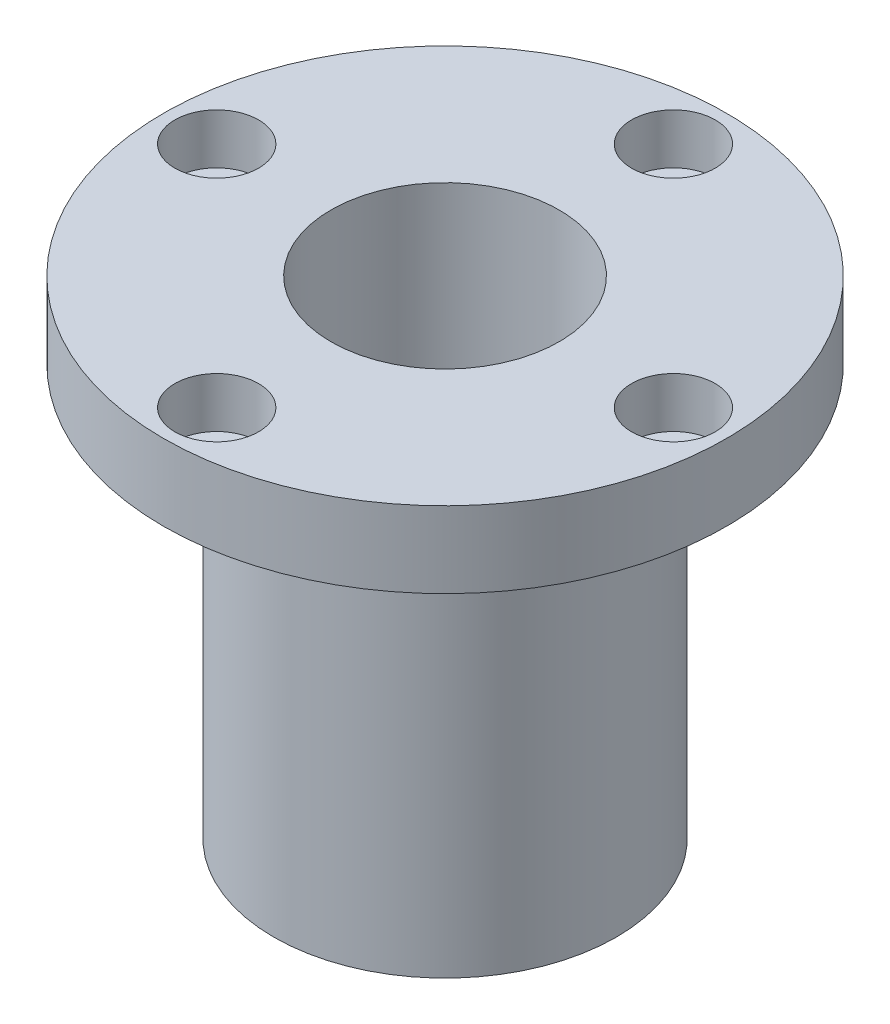
ISO-10303-21;
HEADER;
FILE_DESCRIPTION(('STEP AP214'),'2;1');
FILE_NAME('part.step','',(''),(''),'','','');
FILE_SCHEMA(('AUTOMOTIVE_DESIGN { 1 0 10303 214 1 1 1 1 }'));
ENDSEC;
DATA;
#1=APPLICATION_CONTEXT('core data for automotive mechanical design processes');
#2=APPLICATION_PROTOCOL_DEFINITION('international standard','automotive_design',2000,#1);
#3=PRODUCT_CONTEXT('',#1,'mechanical');
#4=PRODUCT('Part','Part','',(#3));
#5=PRODUCT_RELATED_PRODUCT_CATEGORY('part','',(#4));
#6=PRODUCT_DEFINITION_FORMATION('','',#4);
#7=PRODUCT_DEFINITION_CONTEXT('part definition',#1,'design');
#8=PRODUCT_DEFINITION('design','',#6,#7);
#9=PRODUCT_DEFINITION_SHAPE('','',#8);
#10=(LENGTH_UNIT() NAMED_UNIT(*) SI_UNIT(.MILLI.,.METRE.));
#11=(NAMED_UNIT(*) PLANE_ANGLE_UNIT() SI_UNIT($,.RADIAN.));
#12=(NAMED_UNIT(*) SI_UNIT($,.STERADIAN.) SOLID_ANGLE_UNIT());
#13=UNCERTAINTY_MEASURE_WITH_UNIT(LENGTH_MEASURE(1.E-05),#10,'distance_accuracy_value','');
#14=(GEOMETRIC_REPRESENTATION_CONTEXT(3) GLOBAL_UNCERTAINTY_ASSIGNED_CONTEXT((#13)) GLOBAL_UNIT_ASSIGNED_CONTEXT((#10,
#11,#12)) REPRESENTATION_CONTEXT('',''));
#15=CARTESIAN_POINT('',(0.,0.,0.));
#16=DIRECTION('',(0.,0.,1.));
#17=DIRECTION('',(1.,0.,0.));
#18=AXIS2_PLACEMENT_3D('',#15,#16,#17);
#19=CARTESIAN_POINT('',(0.,64.,0.));
#20=DIRECTION('',(0.,-1.,0.));
#21=DIRECTION('',(0.,0.,-1.));
#22=AXIS2_PLACEMENT_3D('',#19,#20,#21);
#23=CYLINDRICAL_SURFACE('',#22,22.5);
#24=CARTESIAN_POINT('',(0.,0.,0.));
#25=DIRECTION('',(0.,1.,0.));
#26=DIRECTION('',(0.,0.,1.));
#27=AXIS2_PLACEMENT_3D('',#24,#25,#26);
#28=CIRCLE('',#27,22.5);
#29=CARTESIAN_POINT('',(0.,0.,22.5));
#30=VERTEX_POINT('',#29);
#31=EDGE_CURVE('E46',#30,#30,#28,.T.);
#32=ORIENTED_EDGE('',*,*,#31,.T.);
#33=EDGE_LOOP('',(#32));
#34=FACE_BOUND('',#33,.T.);
#35=CARTESIAN_POINT('',(0.,54.,0.));
#36=DIRECTION('',(0.,1.,0.));
#37=DIRECTION('',(0.,0.,1.));
#38=AXIS2_PLACEMENT_3D('',#35,#36,#37);
#39=CIRCLE('',#38,22.5);
#40=CARTESIAN_POINT('',(0.,54.,22.5));
#41=VERTEX_POINT('',#40);
#42=EDGE_CURVE('E10',#41,#41,#39,.T.);
#43=ORIENTED_EDGE('',*,*,#42,.F.);
#44=EDGE_LOOP('',(#43));
#45=FACE_BOUND('',#44,.T.);
#46=ADVANCED_FACE('F39',(#34,#45),#23,.T.);
#47=CARTESIAN_POINT('',(0.,64.,0.));
#48=DIRECTION('',(0.,1.,0.));
#49=DIRECTION('',(0.,0.,1.));
#50=AXIS2_PLACEMENT_3D('',#47,#48,#49);
#51=PLANE('',#50);
#52=CARTESIAN_POINT('',(0.,64.,-30.));
#53=DIRECTION('',(0.,1.,0.));
#54=DIRECTION('',(0.,0.,1.));
#55=AXIS2_PLACEMENT_3D('',#52,#53,#54);
#56=CIRCLE('',#55,5.5);
#57=CARTESIAN_POINT('',(0.,64.,-24.5));
#58=VERTEX_POINT('',#57);
#59=EDGE_CURVE('E83',#58,#58,#56,.T.);
#60=ORIENTED_EDGE('',*,*,#59,.F.);
#61=EDGE_LOOP('',(#60));
#62=FACE_BOUND('',#61,.T.);
#63=CARTESIAN_POINT('',(30.,64.,0.));
#64=DIRECTION('',(0.,1.,0.));
#65=DIRECTION('',(0.,0.,1.));
#66=AXIS2_PLACEMENT_3D('',#63,#64,#65);
#67=CIRCLE('',#66,5.49999999999999);
#68=CARTESIAN_POINT('',(30.,64.,5.49999999999999));
#69=VERTEX_POINT('',#68);
#70=EDGE_CURVE('E86',#69,#69,#67,.T.);
#71=ORIENTED_EDGE('',*,*,#70,.F.);
#72=EDGE_LOOP('',(#71));
#73=FACE_BOUND('',#72,.T.);
#74=CARTESIAN_POINT('',(0.,64.,30.));
#75=DIRECTION('',(0.,1.,0.));
#76=DIRECTION('',(0.,0.,1.));
#77=AXIS2_PLACEMENT_3D('',#74,#75,#76);
#78=CIRCLE('',#77,5.5);
#79=CARTESIAN_POINT('',(0.,64.,35.5));
#80=VERTEX_POINT('',#79);
#81=EDGE_CURVE('E92',#80,#80,#78,.T.);
#82=ORIENTED_EDGE('',*,*,#81,.F.);
#83=EDGE_LOOP('',(#82));
#84=FACE_BOUND('',#83,.T.);
#85=CARTESIAN_POINT('',(-30.,64.,0.));
#86=DIRECTION('',(0.,1.,0.));
#87=DIRECTION('',(0.,0.,1.));
#88=AXIS2_PLACEMENT_3D('',#85,#86,#87);
#89=CIRCLE('',#88,5.5);
#90=CARTESIAN_POINT('',(-30.,64.,5.5));
#91=VERTEX_POINT('',#90);
#92=EDGE_CURVE('E98',#91,#91,#89,.T.);
#93=ORIENTED_EDGE('',*,*,#92,.F.);
#94=EDGE_LOOP('',(#93));
#95=FACE_BOUND('',#94,.T.);
#96=CARTESIAN_POINT('',(0.,64.,0.));
#97=DIRECTION('',(0.,1.,0.));
#98=DIRECTION('',(0.,0.,1.));
#99=AXIS2_PLACEMENT_3D('',#96,#97,#98);
#100=CIRCLE('',#99,15.);
#101=CARTESIAN_POINT('',(0.,64.,15.));
#102=VERTEX_POINT('',#101);
#103=EDGE_CURVE('E51',#102,#102,#100,.T.);
#104=ORIENTED_EDGE('',*,*,#103,.F.);
#105=EDGE_LOOP('',(#104));
#106=FACE_BOUND('',#105,.T.);
#107=CARTESIAN_POINT('',(0.,64.,0.));
#108=DIRECTION('',(0.,1.,0.));
#109=DIRECTION('',(0.,0.,1.));
#110=AXIS2_PLACEMENT_3D('',#107,#108,#109);
#111=CIRCLE('',#110,37.);
#112=CARTESIAN_POINT('',(0.,64.,37.));
#113=VERTEX_POINT('',#112);
#114=EDGE_CURVE('E82',#113,#113,#111,.T.);
#115=ORIENTED_EDGE('',*,*,#114,.T.);
#116=EDGE_LOOP('',(#115));
#117=FACE_BOUND('',#116,.T.);
#118=ADVANCED_FACE('F128',(#62,#73,#84,#95,#106,#117),#51,.T.);
#119=CARTESIAN_POINT('',(0.,0.,0.));
#120=DIRECTION('',(0.,1.,0.));
#121=DIRECTION('',(0.,0.,1.));
#122=AXIS2_PLACEMENT_3D('',#119,#120,#121);
#123=PLANE('',#122);
#124=ORIENTED_EDGE('',*,*,#31,.F.);
#125=EDGE_LOOP('',(#124));
#126=FACE_BOUND('',#125,.T.);
#127=CARTESIAN_POINT('',(0.,0.,0.));
#128=DIRECTION('',(0.,1.,0.));
#129=DIRECTION('',(0.,0.,1.));
#130=AXIS2_PLACEMENT_3D('',#127,#128,#129);
#131=CIRCLE('',#130,15.);
#132=CARTESIAN_POINT('',(0.,0.,15.));
#133=VERTEX_POINT('',#132);
#134=EDGE_CURVE('E106',#133,#133,#131,.T.);
#135=ORIENTED_EDGE('',*,*,#134,.T.);
#136=EDGE_LOOP('',(#135));
#137=FACE_BOUND('',#136,.T.);
#138=ADVANCED_FACE('F113',(#126,#137),#123,.F.);
#139=CARTESIAN_POINT('',(0.,64.,0.));
#140=DIRECTION('',(0.,-1.,0.));
#141=DIRECTION('',(0.,0.,-1.));
#142=AXIS2_PLACEMENT_3D('',#139,#140,#141);
#143=CYLINDRICAL_SURFACE('',#142,15.);
#144=ORIENTED_EDGE('',*,*,#103,.T.);
#145=EDGE_LOOP('',(#144));
#146=FACE_BOUND('',#145,.T.);
#147=ORIENTED_EDGE('',*,*,#134,.F.);
#148=EDGE_LOOP('',(#147));
#149=FACE_BOUND('',#148,.T.);
#150=ADVANCED_FACE('F115',(#146,#149),#143,.F.);
#151=CARTESIAN_POINT('',(0.,54.,0.));
#152=DIRECTION('',(0.,1.,0.));
#153=DIRECTION('',(0.,0.,1.));
#154=AXIS2_PLACEMENT_3D('',#151,#152,#153);
#155=CYLINDRICAL_SURFACE('',#154,37.);
#156=CARTESIAN_POINT('',(0.,54.,0.));
#157=DIRECTION('',(0.,1.,0.));
#158=DIRECTION('',(0.,0.,1.));
#159=AXIS2_PLACEMENT_3D('',#156,#157,#158);
#160=CIRCLE('',#159,37.);
#161=CARTESIAN_POINT('',(0.,54.,37.));
#162=VERTEX_POINT('',#161);
#163=EDGE_CURVE('E103',#162,#162,#160,.T.);
#164=ORIENTED_EDGE('',*,*,#163,.T.);
#165=EDGE_LOOP('',(#164));
#166=FACE_BOUND('',#165,.T.);
#167=ORIENTED_EDGE('',*,*,#114,.F.);
#168=EDGE_LOOP('',(#167));
#169=FACE_BOUND('',#168,.T.);
#170=ADVANCED_FACE('F117',(#166,#169),#155,.T.);
#171=CARTESIAN_POINT('',(0.,54.,0.));
#172=DIRECTION('',(0.,1.,0.));
#173=DIRECTION('',(0.,0.,1.));
#174=AXIS2_PLACEMENT_3D('',#171,#172,#173);
#175=PLANE('',#174);
#176=CARTESIAN_POINT('',(0.,54.,-30.));
#177=DIRECTION('',(0.,1.,0.));
#178=DIRECTION('',(0.,0.,1.));
#179=AXIS2_PLACEMENT_3D('',#176,#177,#178);
#180=CIRCLE('',#179,3.3);
#181=CARTESIAN_POINT('',(0.,54.,-26.7));
#182=VERTEX_POINT('',#181);
#183=EDGE_CURVE('E58',#182,#182,#180,.T.);
#184=ORIENTED_EDGE('',*,*,#183,.T.);
#185=EDGE_LOOP('',(#184));
#186=FACE_BOUND('',#185,.T.);
#187=CARTESIAN_POINT('',(30.,54.,0.));
#188=DIRECTION('',(0.,1.,0.));
#189=DIRECTION('',(0.,0.,1.));
#190=AXIS2_PLACEMENT_3D('',#187,#188,#189);
#191=CIRCLE('',#190,3.3);
#192=CARTESIAN_POINT('',(30.,54.,3.3));
#193=VERTEX_POINT('',#192);
#194=EDGE_CURVE('E61',#193,#193,#191,.T.);
#195=ORIENTED_EDGE('',*,*,#194,.T.);
#196=EDGE_LOOP('',(#195));
#197=FACE_BOUND('',#196,.T.);
#198=CARTESIAN_POINT('',(0.,54.,30.));
#199=DIRECTION('',(0.,1.,0.));
#200=DIRECTION('',(0.,0.,1.));
#201=AXIS2_PLACEMENT_3D('',#198,#199,#200);
#202=CIRCLE('',#201,3.3);
#203=CARTESIAN_POINT('',(0.,54.,33.3));
#204=VERTEX_POINT('',#203);
#205=EDGE_CURVE('E64',#204,#204,#202,.T.);
#206=ORIENTED_EDGE('',*,*,#205,.T.);
#207=EDGE_LOOP('',(#206));
#208=FACE_BOUND('',#207,.T.);
#209=CARTESIAN_POINT('',(-30.,54.,0.));
#210=DIRECTION('',(0.,1.,0.));
#211=DIRECTION('',(0.,0.,1.));
#212=AXIS2_PLACEMENT_3D('',#209,#210,#211);
#213=CIRCLE('',#212,3.3);
#214=CARTESIAN_POINT('',(-30.,54.,3.3));
#215=VERTEX_POINT('',#214);
#216=EDGE_CURVE('E75',#215,#215,#213,.T.);
#217=ORIENTED_EDGE('',*,*,#216,.T.);
#218=EDGE_LOOP('',(#217));
#219=FACE_BOUND('',#218,.T.);
#220=ORIENTED_EDGE('',*,*,#42,.T.);
#221=EDGE_LOOP('',(#220));
#222=FACE_BOUND('',#221,.T.);
#223=ORIENTED_EDGE('',*,*,#163,.F.);
#224=EDGE_LOOP('',(#223));
#225=FACE_BOUND('',#224,.T.);
#226=ADVANCED_FACE('F125',(#186,#197,#208,#219,#222,#225),#175,.F.);
#227=CARTESIAN_POINT('',(-30.,57.4,0.));
#228=DIRECTION('',(0.,1.,0.));
#229=DIRECTION('',(0.,0.,1.));
#230=AXIS2_PLACEMENT_3D('',#227,#228,#229);
#231=CYLINDRICAL_SURFACE('',#230,5.5);
#232=CARTESIAN_POINT('',(-30.,57.4,0.));
#233=DIRECTION('',(0.,1.,0.));
#234=DIRECTION('',(0.,0.,1.));
#235=AXIS2_PLACEMENT_3D('',#232,#233,#234);
#236=CIRCLE('',#235,5.5);
#237=CARTESIAN_POINT('',(-30.,57.4,5.5));
#238=VERTEX_POINT('',#237);
#239=EDGE_CURVE('E78',#238,#238,#236,.T.);
#240=ORIENTED_EDGE('',*,*,#239,.F.);
#241=EDGE_LOOP('',(#240));
#242=FACE_BOUND('',#241,.T.);
#243=ORIENTED_EDGE('',*,*,#92,.T.);
#244=EDGE_LOOP('',(#243));
#245=FACE_BOUND('',#244,.T.);
#246=ADVANCED_FACE('F154',(#242,#245),#231,.F.);
#247=CARTESIAN_POINT('',(-30.,57.4,0.));
#248=DIRECTION('',(0.,1.,0.));
#249=DIRECTION('',(0.,0.,1.));
#250=AXIS2_PLACEMENT_3D('',#247,#248,#249);
#251=PLANE('',#250);
#252=CARTESIAN_POINT('',(-30.,57.4,0.));
#253=DIRECTION('',(0.,1.,0.));
#254=DIRECTION('',(0.,0.,1.));
#255=AXIS2_PLACEMENT_3D('',#252,#253,#254);
#256=CIRCLE('',#255,3.3);
#257=CARTESIAN_POINT('',(-30.,57.4,3.3));
#258=VERTEX_POINT('',#257);
#259=EDGE_CURVE('E42',#258,#258,#256,.T.);
#260=ORIENTED_EDGE('',*,*,#259,.F.);
#261=EDGE_LOOP('',(#260));
#262=FACE_BOUND('',#261,.T.);
#263=ORIENTED_EDGE('',*,*,#239,.T.);
#264=EDGE_LOOP('',(#263));
#265=FACE_BOUND('',#264,.T.);
#266=ADVANCED_FACE('F155',(#262,#265),#251,.T.);
#267=CARTESIAN_POINT('',(0.,57.4,30.));
#268=DIRECTION('',(0.,1.,0.));
#269=DIRECTION('',(0.,0.,1.));
#270=AXIS2_PLACEMENT_3D('',#267,#268,#269);
#271=CYLINDRICAL_SURFACE('',#270,5.5);
#272=CARTESIAN_POINT('',(0.,57.4,30.));
#273=DIRECTION('',(0.,1.,0.));
#274=DIRECTION('',(0.,0.,1.));
#275=AXIS2_PLACEMENT_3D('',#272,#273,#274);
#276=CIRCLE('',#275,5.5);
#277=CARTESIAN_POINT('',(0.,57.4,35.5));
#278=VERTEX_POINT('',#277);
#279=EDGE_CURVE('E95',#278,#278,#276,.T.);
#280=ORIENTED_EDGE('',*,*,#279,.F.);
#281=EDGE_LOOP('',(#280));
#282=FACE_BOUND('',#281,.T.);
#283=ORIENTED_EDGE('',*,*,#81,.T.);
#284=EDGE_LOOP('',(#283));
#285=FACE_BOUND('',#284,.T.);
#286=ADVANCED_FACE('F162',(#282,#285),#271,.F.);
#287=CARTESIAN_POINT('',(0.,57.4,30.));
#288=DIRECTION('',(0.,1.,0.));
#289=DIRECTION('',(0.,0.,1.));
#290=AXIS2_PLACEMENT_3D('',#287,#288,#289);
#291=PLANE('',#290);
#292=CARTESIAN_POINT('',(0.,57.4,30.));
#293=DIRECTION('',(0.,1.,0.));
#294=DIRECTION('',(0.,0.,1.));
#295=AXIS2_PLACEMENT_3D('',#292,#293,#294);
#296=CIRCLE('',#295,3.3);
#297=CARTESIAN_POINT('',(0.,57.4,33.3));
#298=VERTEX_POINT('',#297);
#299=EDGE_CURVE('E62',#298,#298,#296,.T.);
#300=ORIENTED_EDGE('',*,*,#299,.F.);
#301=EDGE_LOOP('',(#300));
#302=FACE_BOUND('',#301,.T.);
#303=ORIENTED_EDGE('',*,*,#279,.T.);
#304=EDGE_LOOP('',(#303));
#305=FACE_BOUND('',#304,.T.);
#306=ADVANCED_FACE('F170',(#302,#305),#291,.T.);
#307=CARTESIAN_POINT('',(30.,57.4,0.));
#308=DIRECTION('',(0.,1.,0.));
#309=DIRECTION('',(0.,0.,1.));
#310=AXIS2_PLACEMENT_3D('',#307,#308,#309);
#311=CYLINDRICAL_SURFACE('',#310,5.49999999999999);
#312=CARTESIAN_POINT('',(30.,57.4,0.));
#313=DIRECTION('',(0.,1.,0.));
#314=DIRECTION('',(0.,0.,1.));
#315=AXIS2_PLACEMENT_3D('',#312,#313,#314);
#316=CIRCLE('',#315,5.49999999999999);
#317=CARTESIAN_POINT('',(30.,57.4,5.49999999999999));
#318=VERTEX_POINT('',#317);
#319=EDGE_CURVE('E89',#318,#318,#316,.T.);
#320=ORIENTED_EDGE('',*,*,#319,.F.);
#321=EDGE_LOOP('',(#320));
#322=FACE_BOUND('',#321,.T.);
#323=ORIENTED_EDGE('',*,*,#70,.T.);
#324=EDGE_LOOP('',(#323));
#325=FACE_BOUND('',#324,.T.);
#326=ADVANCED_FACE('F173',(#322,#325),#311,.F.);
#327=CARTESIAN_POINT('',(30.,57.4,0.));
#328=DIRECTION('',(0.,1.,0.));
#329=DIRECTION('',(0.,0.,1.));
#330=AXIS2_PLACEMENT_3D('',#327,#328,#329);
#331=PLANE('',#330);
#332=CARTESIAN_POINT('',(30.,57.4,0.));
#333=DIRECTION('',(0.,1.,0.));
#334=DIRECTION('',(0.,0.,1.));
#335=AXIS2_PLACEMENT_3D('',#332,#333,#334);
#336=CIRCLE('',#335,3.3);
#337=CARTESIAN_POINT('',(30.,57.4,3.3));
#338=VERTEX_POINT('',#337);
#339=EDGE_CURVE('E59',#338,#338,#336,.T.);
#340=ORIENTED_EDGE('',*,*,#339,.F.);
#341=EDGE_LOOP('',(#340));
#342=FACE_BOUND('',#341,.T.);
#343=ORIENTED_EDGE('',*,*,#319,.T.);
#344=EDGE_LOOP('',(#343));
#345=FACE_BOUND('',#344,.T.);
#346=ADVANCED_FACE('F177',(#342,#345),#331,.T.);
#347=CARTESIAN_POINT('',(0.,57.4,-30.));
#348=DIRECTION('',(0.,1.,0.));
#349=DIRECTION('',(0.,0.,1.));
#350=AXIS2_PLACEMENT_3D('',#347,#348,#349);
#351=CYLINDRICAL_SURFACE('',#350,5.5);
#352=CARTESIAN_POINT('',(0.,57.4,-30.));
#353=DIRECTION('',(0.,1.,0.));
#354=DIRECTION('',(0.,0.,1.));
#355=AXIS2_PLACEMENT_3D('',#352,#353,#354);
#356=CIRCLE('',#355,5.5);
#357=CARTESIAN_POINT('',(0.,57.4,-24.5));
#358=VERTEX_POINT('',#357);
#359=EDGE_CURVE('E79',#358,#358,#356,.T.);
#360=ORIENTED_EDGE('',*,*,#359,.F.);
#361=EDGE_LOOP('',(#360));
#362=FACE_BOUND('',#361,.T.);
#363=ORIENTED_EDGE('',*,*,#59,.T.);
#364=EDGE_LOOP('',(#363));
#365=FACE_BOUND('',#364,.T.);
#366=ADVANCED_FACE('F180',(#362,#365),#351,.F.);
#367=CARTESIAN_POINT('',(0.,57.4,-30.));
#368=DIRECTION('',(0.,1.,0.));
#369=DIRECTION('',(0.,0.,1.));
#370=AXIS2_PLACEMENT_3D('',#367,#368,#369);
#371=PLANE('',#370);
#372=CARTESIAN_POINT('',(0.,57.4,-30.));
#373=DIRECTION('',(0.,1.,0.));
#374=DIRECTION('',(0.,0.,1.));
#375=AXIS2_PLACEMENT_3D('',#372,#373,#374);
#376=CIRCLE('',#375,3.3);
#377=CARTESIAN_POINT('',(0.,57.4,-26.7));
#378=VERTEX_POINT('',#377);
#379=EDGE_CURVE('E55',#378,#378,#376,.T.);
#380=ORIENTED_EDGE('',*,*,#379,.F.);
#381=EDGE_LOOP('',(#380));
#382=FACE_BOUND('',#381,.T.);
#383=ORIENTED_EDGE('',*,*,#359,.T.);
#384=EDGE_LOOP('',(#383));
#385=FACE_BOUND('',#384,.T.);
#386=ADVANCED_FACE('F187',(#382,#385),#371,.T.);
#387=CARTESIAN_POINT('',(0.,0.,-30.));
#388=DIRECTION('',(0.,1.,0.));
#389=DIRECTION('',(0.,0.,1.));
#390=AXIS2_PLACEMENT_3D('',#387,#388,#389);
#391=CYLINDRICAL_SURFACE('',#390,3.3);
#392=ORIENTED_EDGE('',*,*,#379,.T.);
#393=EDGE_LOOP('',(#392));
#394=FACE_BOUND('',#393,.T.);
#395=ORIENTED_EDGE('',*,*,#183,.F.);
#396=EDGE_LOOP('',(#395));
#397=FACE_BOUND('',#396,.T.);
#398=ADVANCED_FACE('F191',(#394,#397),#391,.F.);
#399=CARTESIAN_POINT('',(30.,0.,0.));
#400=DIRECTION('',(0.,1.,0.));
#401=DIRECTION('',(0.,0.,1.));
#402=AXIS2_PLACEMENT_3D('',#399,#400,#401);
#403=CYLINDRICAL_SURFACE('',#402,3.3);
#404=ORIENTED_EDGE('',*,*,#339,.T.);
#405=EDGE_LOOP('',(#404));
#406=FACE_BOUND('',#405,.T.);
#407=ORIENTED_EDGE('',*,*,#194,.F.);
#408=EDGE_LOOP('',(#407));
#409=FACE_BOUND('',#408,.T.);
#410=ADVANCED_FACE('F200',(#406,#409),#403,.F.);
#411=CARTESIAN_POINT('',(0.,0.,30.));
#412=DIRECTION('',(0.,1.,0.));
#413=DIRECTION('',(0.,0.,1.));
#414=AXIS2_PLACEMENT_3D('',#411,#412,#413);
#415=CYLINDRICAL_SURFACE('',#414,3.3);
#416=ORIENTED_EDGE('',*,*,#299,.T.);
#417=EDGE_LOOP('',(#416));
#418=FACE_BOUND('',#417,.T.);
#419=ORIENTED_EDGE('',*,*,#205,.F.);
#420=EDGE_LOOP('',(#419));
#421=FACE_BOUND('',#420,.T.);
#422=ADVANCED_FACE('F196',(#418,#421),#415,.F.);
#423=CARTESIAN_POINT('',(-30.,0.,0.));
#424=DIRECTION('',(0.,1.,0.));
#425=DIRECTION('',(0.,0.,1.));
#426=AXIS2_PLACEMENT_3D('',#423,#424,#425);
#427=CYLINDRICAL_SURFACE('',#426,3.3);
#428=ORIENTED_EDGE('',*,*,#259,.T.);
#429=EDGE_LOOP('',(#428));
#430=FACE_BOUND('',#429,.T.);
#431=ORIENTED_EDGE('',*,*,#216,.F.);
#432=EDGE_LOOP('',(#431));
#433=FACE_BOUND('',#432,.T.);
#434=ADVANCED_FACE('F193',(#430,#433),#427,.F.);
#435=CLOSED_SHELL('',(#46,#118,#138,#150,#170,#226,#246,#266,#286,#306,#326,#346,#366,#386,#398,
#410,#422,#434));
#436=MANIFOLD_SOLID_BREP('B2',#435);
#437=ADVANCED_BREP_SHAPE_REPRESENTATION('',(#18,#436),#14);
#438=SHAPE_DEFINITION_REPRESENTATION(#9,#437);
ENDSEC;
END-ISO-10303-21;
